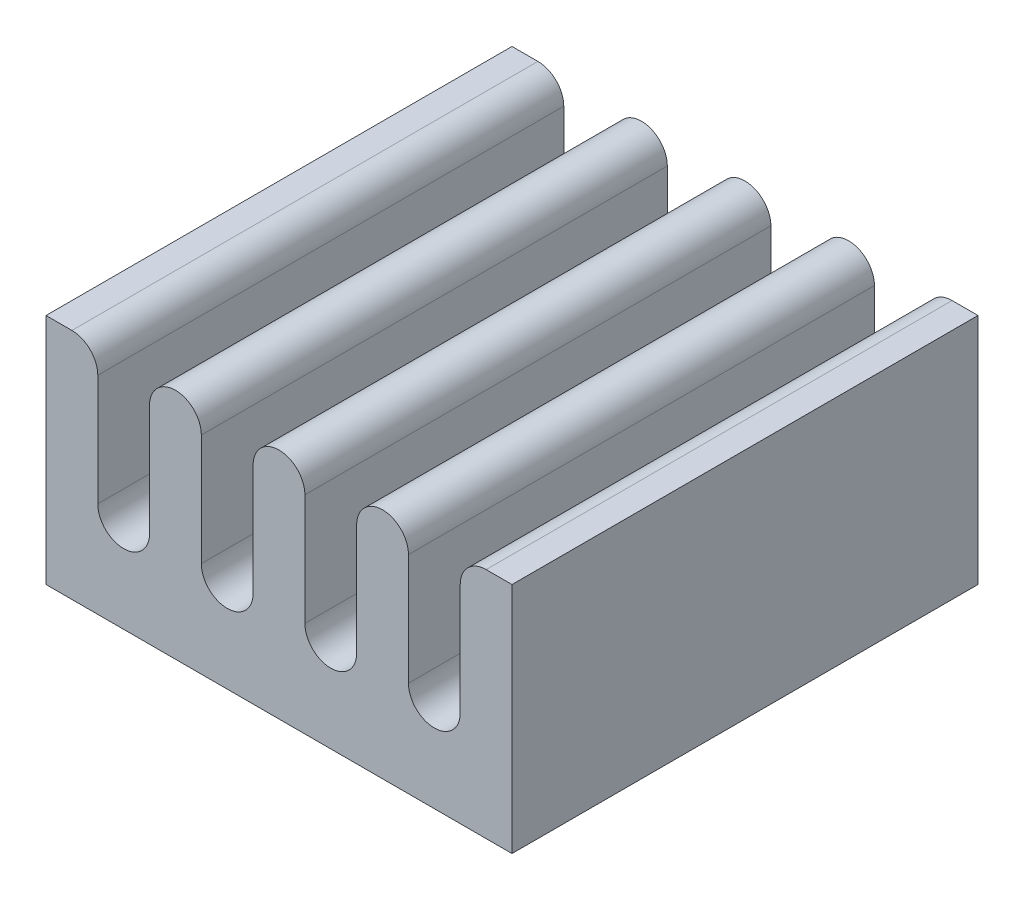
ISO-10303-21;
HEADER;
FILE_DESCRIPTION(('STEP AP214'),'2;1');
FILE_NAME('part.step','',(''),(''),'','','');
FILE_SCHEMA(('AUTOMOTIVE_DESIGN { 1 0 10303 214 1 1 1 1 }'));
ENDSEC;
DATA;
#1=APPLICATION_CONTEXT('core data for automotive mechanical design processes');
#2=APPLICATION_PROTOCOL_DEFINITION('international standard','automotive_design',2000,#1);
#3=PRODUCT_CONTEXT('',#1,'mechanical');
#4=PRODUCT('Part','Part','',(#3));
#5=PRODUCT_RELATED_PRODUCT_CATEGORY('part','',(#4));
#6=PRODUCT_DEFINITION_FORMATION('','',#4);
#7=PRODUCT_DEFINITION_CONTEXT('part definition',#1,'design');
#8=PRODUCT_DEFINITION('design','',#6,#7);
#9=PRODUCT_DEFINITION_SHAPE('','',#8);
#10=(LENGTH_UNIT() NAMED_UNIT(*) SI_UNIT(.MILLI.,.METRE.));
#11=(NAMED_UNIT(*) PLANE_ANGLE_UNIT() SI_UNIT($,.RADIAN.));
#12=(NAMED_UNIT(*) SI_UNIT($,.STERADIAN.) SOLID_ANGLE_UNIT());
#13=UNCERTAINTY_MEASURE_WITH_UNIT(LENGTH_MEASURE(1.E-05),#10,'distance_accuracy_value','');
#14=(GEOMETRIC_REPRESENTATION_CONTEXT(3) GLOBAL_UNCERTAINTY_ASSIGNED_CONTEXT((#13)) GLOBAL_UNIT_ASSIGNED_CONTEXT((#10,
#11,#12)) REPRESENTATION_CONTEXT('',''));
#15=CARTESIAN_POINT('',(0.,0.,0.));
#16=DIRECTION('',(0.,0.,1.));
#17=DIRECTION('',(1.,0.,0.));
#18=AXIS2_PLACEMENT_3D('',#15,#16,#17);
#19=CARTESIAN_POINT('',(4.,4.5,-4.5));
#20=DIRECTION('',(0.,0.,1.));
#21=DIRECTION('',(1.,0.,0.));
#22=AXIS2_PLACEMENT_3D('',#19,#20,#21);
#23=CYLINDRICAL_SURFACE('',#22,0.5);
#24=CARTESIAN_POINT('',(4.,4.5,-4.5));
#25=DIRECTION('',(0.,0.,1.));
#26=DIRECTION('',(1.,0.,0.));
#27=AXIS2_PLACEMENT_3D('',#24,#25,#26);
#28=CIRCLE('',#27,0.5);
#29=CARTESIAN_POINT('',(4.,5.,-4.5));
#30=VERTEX_POINT('',#29);
#31=CARTESIAN_POINT('',(3.5,4.5,-4.5));
#32=VERTEX_POINT('',#31);
#33=EDGE_CURVE('E416',#30,#32,#28,.T.);
#34=ORIENTED_EDGE('',*,*,#33,.T.);
#35=DIRECTION('',(0.,0.,1.));
#36=VECTOR('',#35,1.);
#37=CARTESIAN_POINT('',(3.5,4.5,-4.5));
#38=LINE('',#37,#36);
#39=CARTESIAN_POINT('',(3.5,4.5,4.5));
#40=VERTEX_POINT('',#39);
#41=EDGE_CURVE('E316',#32,#40,#38,.T.);
#42=ORIENTED_EDGE('',*,*,#41,.T.);
#43=CARTESIAN_POINT('',(4.,4.5,4.5));
#44=DIRECTION('',(0.,0.,-1.));
#45=DIRECTION('',(1.,0.,0.));
#46=AXIS2_PLACEMENT_3D('',#43,#44,#45);
#47=CIRCLE('',#46,0.5);
#48=CARTESIAN_POINT('',(4.,5.,4.5));
#49=VERTEX_POINT('',#48);
#50=EDGE_CURVE('E439',#40,#49,#47,.T.);
#51=ORIENTED_EDGE('',*,*,#50,.T.);
#52=DIRECTION('',(0.,0.,1.));
#53=VECTOR('',#52,1.);
#54=CARTESIAN_POINT('',(4.,5.,0.));
#55=LINE('',#54,#53);
#56=EDGE_CURVE('E11',#30,#49,#55,.T.);
#57=ORIENTED_EDGE('',*,*,#56,.F.);
#58=EDGE_LOOP('',(#34,#42,#51,#57));
#59=FACE_BOUND('',#58,.T.);
#60=ADVANCED_FACE('F17',(#59),#23,.T.);
#61=CARTESIAN_POINT('',(3.,2.35,-4.5));
#62=DIRECTION('',(0.,0.,-1.));
#63=DIRECTION('',(-1.,0.,0.));
#64=AXIS2_PLACEMENT_3D('',#61,#62,#63);
#65=CYLINDRICAL_SURFACE('',#64,0.5);
#66=CARTESIAN_POINT('',(3.,2.35,4.5));
#67=DIRECTION('',(0.,0.,-1.));
#68=DIRECTION('',(-1.,0.,0.));
#69=AXIS2_PLACEMENT_3D('',#66,#67,#68);
#70=CIRCLE('',#69,0.5);
#71=CARTESIAN_POINT('',(3.5,2.35,4.5));
#72=VERTEX_POINT('',#71);
#73=CARTESIAN_POINT('',(2.5,2.35,4.5));
#74=VERTEX_POINT('',#73);
#75=EDGE_CURVE('E444',#72,#74,#70,.T.);
#76=ORIENTED_EDGE('',*,*,#75,.F.);
#77=DIRECTION('',(0.,0.,-1.));
#78=VECTOR('',#77,1.);
#79=CARTESIAN_POINT('',(3.5,2.35,-4.5));
#80=LINE('',#79,#78);
#81=CARTESIAN_POINT('',(3.5,2.35,-4.5));
#82=VERTEX_POINT('',#81);
#83=EDGE_CURVE('E313',#72,#82,#80,.T.);
#84=ORIENTED_EDGE('',*,*,#83,.T.);
#85=CARTESIAN_POINT('',(3.,2.35,-4.5));
#86=DIRECTION('',(0.,0.,1.));
#87=DIRECTION('',(-1.,0.,0.));
#88=AXIS2_PLACEMENT_3D('',#85,#86,#87);
#89=CIRCLE('',#88,0.5);
#90=CARTESIAN_POINT('',(2.5,2.35,-4.5));
#91=VERTEX_POINT('',#90);
#92=EDGE_CURVE('E406',#91,#82,#89,.T.);
#93=ORIENTED_EDGE('',*,*,#92,.F.);
#94=DIRECTION('',(0.,0.,1.));
#95=VECTOR('',#94,1.);
#96=CARTESIAN_POINT('',(2.5,2.35,-4.5));
#97=LINE('',#96,#95);
#98=EDGE_CURVE('E312',#91,#74,#97,.T.);
#99=ORIENTED_EDGE('',*,*,#98,.T.);
#100=EDGE_LOOP('',(#76,#84,#93,#99));
#101=FACE_BOUND('',#100,.T.);
#102=ADVANCED_FACE('F1116',(#101),#65,.F.);
#103=CARTESIAN_POINT('',(2.,4.5,-4.5));
#104=DIRECTION('',(0.,0.,1.));
#105=DIRECTION('',(1.,0.,0.));
#106=AXIS2_PLACEMENT_3D('',#103,#104,#105);
#107=CYLINDRICAL_SURFACE('',#106,0.5);
#108=CARTESIAN_POINT('',(2.,4.5,-4.5));
#109=DIRECTION('',(0.,0.,1.));
#110=DIRECTION('',(1.,0.,0.));
#111=AXIS2_PLACEMENT_3D('',#108,#109,#110);
#112=CIRCLE('',#111,0.5);
#113=CARTESIAN_POINT('',(2.5,4.5,-4.5));
#114=VERTEX_POINT('',#113);
#115=CARTESIAN_POINT('',(1.5,4.5,-4.5));
#116=VERTEX_POINT('',#115);
#117=EDGE_CURVE('E394',#114,#116,#112,.T.);
#118=ORIENTED_EDGE('',*,*,#117,.T.);
#119=DIRECTION('',(0.,0.,1.));
#120=VECTOR('',#119,1.);
#121=CARTESIAN_POINT('',(1.5,4.5,-4.5));
#122=LINE('',#121,#120);
#123=CARTESIAN_POINT('',(1.5,4.5,4.5));
#124=VERTEX_POINT('',#123);
#125=EDGE_CURVE('E309',#116,#124,#122,.T.);
#126=ORIENTED_EDGE('',*,*,#125,.T.);
#127=CARTESIAN_POINT('',(2.,4.5,4.5));
#128=DIRECTION('',(0.,0.,-1.));
#129=DIRECTION('',(1.,0.,0.));
#130=AXIS2_PLACEMENT_3D('',#127,#128,#129);
#131=CIRCLE('',#130,0.5);
#132=CARTESIAN_POINT('',(2.5,4.5,4.5));
#133=VERTEX_POINT('',#132);
#134=EDGE_CURVE('E452',#124,#133,#131,.T.);
#135=ORIENTED_EDGE('',*,*,#134,.T.);
#136=DIRECTION('',(0.,0.,-1.));
#137=VECTOR('',#136,1.);
#138=CARTESIAN_POINT('',(2.5,4.5,-4.5));
#139=LINE('',#138,#137);
#140=EDGE_CURVE('E317',#133,#114,#139,.T.);
#141=ORIENTED_EDGE('',*,*,#140,.T.);
#142=EDGE_LOOP('',(#118,#126,#135,#141));
#143=FACE_BOUND('',#142,.T.);
#144=ADVANCED_FACE('F1099',(#143),#107,.T.);
#145=CARTESIAN_POINT('',(1.,2.35,-4.5));
#146=DIRECTION('',(0.,0.,-1.));
#147=DIRECTION('',(-1.,0.,0.));
#148=AXIS2_PLACEMENT_3D('',#145,#146,#147);
#149=CYLINDRICAL_SURFACE('',#148,0.5);
#150=CARTESIAN_POINT('',(1.,2.35,4.5));
#151=DIRECTION('',(0.,0.,-1.));
#152=DIRECTION('',(-1.,0.,0.));
#153=AXIS2_PLACEMENT_3D('',#150,#151,#152);
#154=CIRCLE('',#153,0.5);
#155=CARTESIAN_POINT('',(1.5,2.35,4.5));
#156=VERTEX_POINT('',#155);
#157=CARTESIAN_POINT('',(0.5,2.35,4.5));
#158=VERTEX_POINT('',#157);
#159=EDGE_CURVE('E460',#156,#158,#154,.T.);
#160=ORIENTED_EDGE('',*,*,#159,.F.);
#161=DIRECTION('',(0.,0.,-1.));
#162=VECTOR('',#161,1.);
#163=CARTESIAN_POINT('',(1.5,2.35,-4.5));
#164=LINE('',#163,#162);
#165=CARTESIAN_POINT('',(1.5,2.35,-4.5));
#166=VERTEX_POINT('',#165);
#167=EDGE_CURVE('E306',#156,#166,#164,.T.);
#168=ORIENTED_EDGE('',*,*,#167,.T.);
#169=CARTESIAN_POINT('',(1.,2.35,-4.5));
#170=DIRECTION('',(0.,0.,1.));
#171=DIRECTION('',(-1.,0.,0.));
#172=AXIS2_PLACEMENT_3D('',#169,#170,#171);
#173=CIRCLE('',#172,0.5);
#174=CARTESIAN_POINT('',(0.5,2.35,-4.5));
#175=VERTEX_POINT('',#174);
#176=EDGE_CURVE('E384',#175,#166,#173,.T.);
#177=ORIENTED_EDGE('',*,*,#176,.F.);
#178=DIRECTION('',(0.,0.,1.));
#179=VECTOR('',#178,1.);
#180=CARTESIAN_POINT('',(0.5,2.35,-4.5));
#181=LINE('',#180,#179);
#182=EDGE_CURVE('E300',#175,#158,#181,.T.);
#183=ORIENTED_EDGE('',*,*,#182,.T.);
#184=EDGE_LOOP('',(#160,#168,#177,#183));
#185=FACE_BOUND('',#184,.T.);
#186=ADVANCED_FACE('F1095',(#185),#149,.F.);
#187=CARTESIAN_POINT('',(0.,4.5,-4.5));
#188=DIRECTION('',(0.,0.,1.));
#189=DIRECTION('',(1.,0.,0.));
#190=AXIS2_PLACEMENT_3D('',#187,#188,#189);
#191=CYLINDRICAL_SURFACE('',#190,0.5);
#192=CARTESIAN_POINT('',(0.,4.5,-4.5));
#193=DIRECTION('',(0.,0.,1.));
#194=DIRECTION('',(1.,0.,0.));
#195=AXIS2_PLACEMENT_3D('',#192,#193,#194);
#196=CIRCLE('',#195,0.5);
#197=CARTESIAN_POINT('',(0.5,4.5,-4.5));
#198=VERTEX_POINT('',#197);
#199=CARTESIAN_POINT('',(-0.5,4.5,-4.5));
#200=VERTEX_POINT('',#199);
#201=EDGE_CURVE('E376',#198,#200,#196,.T.);
#202=ORIENTED_EDGE('',*,*,#201,.T.);
#203=DIRECTION('',(0.,0.,1.));
#204=VECTOR('',#203,1.);
#205=CARTESIAN_POINT('',(-0.5,4.5,-4.5));
#206=LINE('',#205,#204);
#207=CARTESIAN_POINT('',(-0.5,4.5,4.5));
#208=VERTEX_POINT('',#207);
#209=EDGE_CURVE('E297',#200,#208,#206,.T.);
#210=ORIENTED_EDGE('',*,*,#209,.T.);
#211=CARTESIAN_POINT('',(0.,4.5,4.5));
#212=DIRECTION('',(0.,0.,-1.));
#213=DIRECTION('',(1.,0.,0.));
#214=AXIS2_PLACEMENT_3D('',#211,#212,#213);
#215=CIRCLE('',#214,0.5);
#216=CARTESIAN_POINT('',(0.5,4.5,4.5));
#217=VERTEX_POINT('',#216);
#218=EDGE_CURVE('E468',#208,#217,#215,.T.);
#219=ORIENTED_EDGE('',*,*,#218,.T.);
#220=DIRECTION('',(0.,0.,-1.));
#221=VECTOR('',#220,1.);
#222=CARTESIAN_POINT('',(0.5,4.5,-4.5));
#223=LINE('',#222,#221);
#224=EDGE_CURVE('E303',#217,#198,#223,.T.);
#225=ORIENTED_EDGE('',*,*,#224,.T.);
#226=EDGE_LOOP('',(#202,#210,#219,#225));
#227=FACE_BOUND('',#226,.T.);
#228=ADVANCED_FACE('F1089',(#227),#191,.T.);
#229=CARTESIAN_POINT('',(-1.,2.35,-4.5));
#230=DIRECTION('',(0.,0.,-1.));
#231=DIRECTION('',(-1.,0.,0.));
#232=AXIS2_PLACEMENT_3D('',#229,#230,#231);
#233=CYLINDRICAL_SURFACE('',#232,0.5);
#234=CARTESIAN_POINT('',(-1.,2.35,4.5));
#235=DIRECTION('',(0.,0.,-1.));
#236=DIRECTION('',(-1.,0.,0.));
#237=AXIS2_PLACEMENT_3D('',#234,#235,#236);
#238=CIRCLE('',#237,0.5);
#239=CARTESIAN_POINT('',(-0.5,2.35,4.5));
#240=VERTEX_POINT('',#239);
#241=CARTESIAN_POINT('',(-1.5,2.35,4.5));
#242=VERTEX_POINT('',#241);
#243=EDGE_CURVE('E476',#240,#242,#238,.T.);
#244=ORIENTED_EDGE('',*,*,#243,.F.);
#245=DIRECTION('',(0.,0.,-1.));
#246=VECTOR('',#245,1.);
#247=CARTESIAN_POINT('',(-0.5,2.35,-4.5));
#248=LINE('',#247,#246);
#249=CARTESIAN_POINT('',(-0.5,2.35,-4.5));
#250=VERTEX_POINT('',#249);
#251=EDGE_CURVE('E294',#240,#250,#248,.T.);
#252=ORIENTED_EDGE('',*,*,#251,.T.);
#253=CARTESIAN_POINT('',(-1.,2.35,-4.5));
#254=DIRECTION('',(0.,0.,1.));
#255=DIRECTION('',(-1.,0.,0.));
#256=AXIS2_PLACEMENT_3D('',#253,#254,#255);
#257=CIRCLE('',#256,0.5);
#258=CARTESIAN_POINT('',(-1.5,2.35,-4.5));
#259=VERTEX_POINT('',#258);
#260=EDGE_CURVE('E368',#259,#250,#257,.T.);
#261=ORIENTED_EDGE('',*,*,#260,.F.);
#262=DIRECTION('',(0.,0.,1.));
#263=VECTOR('',#262,1.);
#264=CARTESIAN_POINT('',(-1.5,2.35,-4.5));
#265=LINE('',#264,#263);
#266=EDGE_CURVE('E289',#259,#242,#265,.T.);
#267=ORIENTED_EDGE('',*,*,#266,.T.);
#268=EDGE_LOOP('',(#244,#252,#261,#267));
#269=FACE_BOUND('',#268,.T.);
#270=ADVANCED_FACE('F1080',(#269),#233,.F.);
#271=CARTESIAN_POINT('',(-2.,4.5,-4.5));
#272=DIRECTION('',(0.,0.,1.));
#273=DIRECTION('',(1.,0.,0.));
#274=AXIS2_PLACEMENT_3D('',#271,#272,#273);
#275=CYLINDRICAL_SURFACE('',#274,0.5);
#276=CARTESIAN_POINT('',(-2.,4.5,-4.5));
#277=DIRECTION('',(0.,0.,1.));
#278=DIRECTION('',(1.,0.,0.));
#279=AXIS2_PLACEMENT_3D('',#276,#277,#278);
#280=CIRCLE('',#279,0.5);
#281=CARTESIAN_POINT('',(-1.5,4.5,-4.5));
#282=VERTEX_POINT('',#281);
#283=CARTESIAN_POINT('',(-2.5,4.5,-4.5));
#284=VERTEX_POINT('',#283);
#285=EDGE_CURVE('E663',#282,#284,#280,.T.);
#286=ORIENTED_EDGE('',*,*,#285,.T.);
#287=DIRECTION('',(0.,0.,1.));
#288=VECTOR('',#287,1.);
#289=CARTESIAN_POINT('',(-2.5,4.5,-4.5));
#290=LINE('',#289,#288);
#291=CARTESIAN_POINT('',(-2.5,4.5,4.5));
#292=VERTEX_POINT('',#291);
#293=EDGE_CURVE('E293',#284,#292,#290,.T.);
#294=ORIENTED_EDGE('',*,*,#293,.T.);
#295=CARTESIAN_POINT('',(-2.,4.5,4.5));
#296=DIRECTION('',(0.,0.,-1.));
#297=DIRECTION('',(1.,0.,0.));
#298=AXIS2_PLACEMENT_3D('',#295,#296,#297);
#299=CIRCLE('',#298,0.5);
#300=CARTESIAN_POINT('',(-1.5,4.5,4.5));
#301=VERTEX_POINT('',#300);
#302=EDGE_CURVE('E362',#292,#301,#299,.T.);
#303=ORIENTED_EDGE('',*,*,#302,.T.);
#304=DIRECTION('',(0.,0.,-1.));
#305=VECTOR('',#304,1.);
#306=CARTESIAN_POINT('',(-1.5,4.5,-4.5));
#307=LINE('',#306,#305);
#308=EDGE_CURVE('E292',#301,#282,#307,.T.);
#309=ORIENTED_EDGE('',*,*,#308,.T.);
#310=EDGE_LOOP('',(#286,#294,#303,#309));
#311=FACE_BOUND('',#310,.T.);
#312=ADVANCED_FACE('F1072',(#311),#275,.T.);
#313=CARTESIAN_POINT('',(-4.,4.5,-4.5));
#314=DIRECTION('',(0.,0.,-1.));
#315=DIRECTION('',(-1.,0.,0.));
#316=AXIS2_PLACEMENT_3D('',#313,#314,#315);
#317=CYLINDRICAL_SURFACE('',#316,0.5);
#318=CARTESIAN_POINT('',(-4.,4.5,4.5));
#319=DIRECTION('',(0.,0.,-1.));
#320=DIRECTION('',(-1.,0.,0.));
#321=AXIS2_PLACEMENT_3D('',#318,#319,#320);
#322=CIRCLE('',#321,0.5);
#323=CARTESIAN_POINT('',(-4.,5.,4.5));
#324=VERTEX_POINT('',#323);
#325=CARTESIAN_POINT('',(-3.5,4.5,4.5));
#326=VERTEX_POINT('',#325);
#327=EDGE_CURVE('E496',#324,#326,#322,.T.);
#328=ORIENTED_EDGE('',*,*,#327,.T.);
#329=DIRECTION('',(0.,0.,-1.));
#330=VECTOR('',#329,1.);
#331=CARTESIAN_POINT('',(-3.5,4.5,-4.5));
#332=LINE('',#331,#330);
#333=CARTESIAN_POINT('',(-3.5,4.5,-4.5));
#334=VERTEX_POINT('',#333);
#335=EDGE_CURVE('E285',#326,#334,#332,.T.);
#336=ORIENTED_EDGE('',*,*,#335,.T.);
#337=CARTESIAN_POINT('',(-4.,4.5,-4.5));
#338=DIRECTION('',(0.,0.,1.));
#339=DIRECTION('',(-1.,0.,0.));
#340=AXIS2_PLACEMENT_3D('',#337,#338,#339);
#341=CIRCLE('',#340,0.5);
#342=CARTESIAN_POINT('',(-4.,5.,-4.5));
#343=VERTEX_POINT('',#342);
#344=EDGE_CURVE('E335',#334,#343,#341,.T.);
#345=ORIENTED_EDGE('',*,*,#344,.T.);
#346=DIRECTION('',(0.,0.,-1.));
#347=VECTOR('',#346,1.);
#348=CARTESIAN_POINT('',(-4.,5.,0.));
#349=LINE('',#348,#347);
#350=EDGE_CURVE('E26',#324,#343,#349,.T.);
#351=ORIENTED_EDGE('',*,*,#350,.F.);
#352=EDGE_LOOP('',(#328,#336,#345,#351));
#353=FACE_BOUND('',#352,.T.);
#354=ADVANCED_FACE('F336',(#353),#317,.T.);
#355=CARTESIAN_POINT('',(-3.,2.35,-4.5));
#356=DIRECTION('',(0.,0.,-1.));
#357=DIRECTION('',(-1.,0.,0.));
#358=AXIS2_PLACEMENT_3D('',#355,#356,#357);
#359=CYLINDRICAL_SURFACE('',#358,0.5);
#360=CARTESIAN_POINT('',(-3.,2.35,4.5));
#361=DIRECTION('',(0.,0.,-1.));
#362=DIRECTION('',(-1.,0.,0.));
#363=AXIS2_PLACEMENT_3D('',#360,#361,#362);
#364=CIRCLE('',#363,0.5);
#365=CARTESIAN_POINT('',(-2.5,2.35,4.5));
#366=VERTEX_POINT('',#365);
#367=CARTESIAN_POINT('',(-3.5,2.35,4.5));
#368=VERTEX_POINT('',#367);
#369=EDGE_CURVE('E361',#366,#368,#364,.T.);
#370=ORIENTED_EDGE('',*,*,#369,.F.);
#371=DIRECTION('',(0.,0.,-1.));
#372=VECTOR('',#371,1.);
#373=CARTESIAN_POINT('',(-2.5,2.35,-4.5));
#374=LINE('',#373,#372);
#375=CARTESIAN_POINT('',(-2.5,2.35,-4.5));
#376=VERTEX_POINT('',#375);
#377=EDGE_CURVE('E288',#366,#376,#374,.T.);
#378=ORIENTED_EDGE('',*,*,#377,.T.);
#379=CARTESIAN_POINT('',(-3.,2.35,-4.5));
#380=DIRECTION('',(0.,0.,1.));
#381=DIRECTION('',(-1.,0.,0.));
#382=AXIS2_PLACEMENT_3D('',#379,#380,#381);
#383=CIRCLE('',#382,0.5);
#384=CARTESIAN_POINT('',(-3.5,2.35,-4.5));
#385=VERTEX_POINT('',#384);
#386=EDGE_CURVE('E363',#385,#376,#383,.T.);
#387=ORIENTED_EDGE('',*,*,#386,.F.);
#388=DIRECTION('',(0.,0.,1.));
#389=VECTOR('',#388,1.);
#390=CARTESIAN_POINT('',(-3.5,2.35,-4.5));
#391=LINE('',#390,#389);
#392=EDGE_CURVE('E282',#385,#368,#391,.T.);
#393=ORIENTED_EDGE('',*,*,#392,.T.);
#394=EDGE_LOOP('',(#370,#378,#387,#393));
#395=FACE_BOUND('',#394,.T.);
#396=ADVANCED_FACE('F1056',(#395),#359,.F.);
#397=CARTESIAN_POINT('',(0.,0.,0.));
#398=DIRECTION('',(0.,1.,0.));
#399=DIRECTION('',(1.,0.,0.));
#400=AXIS2_PLACEMENT_3D('',#397,#398,#399);
#401=PLANE('',#400);
#402=DIRECTION('',(-1.,0.,0.));
#403=VECTOR('',#402,1.);
#404=CARTESIAN_POINT('',(-3.5,0.,-4.));
#405=LINE('',#404,#403);
#406=CARTESIAN_POINT('',(2.5,0.,-4.));
#407=VERTEX_POINT('',#406);
#408=CARTESIAN_POINT('',(-3.5,0.,-4.));
#409=VERTEX_POINT('',#408);
#410=EDGE_CURVE('E239',#407,#409,#405,.T.);
#411=ORIENTED_EDGE('',*,*,#410,.F.);
#412=DIRECTION('',(0.,0.,-1.));
#413=VECTOR('',#412,1.);
#414=CARTESIAN_POINT('',(2.5,0.,2.));
#415=LINE('',#414,#413);
#416=CARTESIAN_POINT('',(2.5,0.,2.));
#417=VERTEX_POINT('',#416);
#418=EDGE_CURVE('E279',#417,#407,#415,.T.);
#419=ORIENTED_EDGE('',*,*,#418,.F.);
#420=DIRECTION('',(1.,0.,0.));
#421=VECTOR('',#420,1.);
#422=CARTESIAN_POINT('',(-3.5,0.,2.));
#423=LINE('',#422,#421);
#424=CARTESIAN_POINT('',(-3.5,0.,2.));
#425=VERTEX_POINT('',#424);
#426=EDGE_CURVE('E39',#425,#417,#423,.T.);
#427=ORIENTED_EDGE('',*,*,#426,.F.);
#428=DIRECTION('',(0.,0.,1.));
#429=VECTOR('',#428,1.);
#430=CARTESIAN_POINT('',(-3.5,0.,2.));
#431=LINE('',#430,#429);
#432=EDGE_CURVE('E252',#409,#425,#431,.T.);
#433=ORIENTED_EDGE('',*,*,#432,.F.);
#434=EDGE_LOOP('',(#411,#419,#427,#433));
#435=FACE_BOUND('',#434,.T.);
#436=ADVANCED_FACE('F253',(#435),#401,.F.);
#437=CARTESIAN_POINT('',(0.,5.,0.));
#438=DIRECTION('',(0.,1.,0.));
#439=DIRECTION('',(1.,0.,0.));
#440=AXIS2_PLACEMENT_3D('',#437,#438,#439);
#441=PLANE('',#440);
#442=DIRECTION('',(1.,0.,0.));
#443=VECTOR('',#442,1.);
#444=CARTESIAN_POINT('',(0.,5.,4.5));
#445=LINE('',#444,#443);
#446=CARTESIAN_POINT('',(4.5,5.,4.5));
#447=VERTEX_POINT('',#446);
#448=EDGE_CURVE('E435',#49,#447,#445,.T.);
#449=ORIENTED_EDGE('',*,*,#448,.T.);
#450=DIRECTION('',(0.,0.,-1.));
#451=VECTOR('',#450,1.);
#452=CARTESIAN_POINT('',(4.5,5.,-4.5));
#453=LINE('',#452,#451);
#454=CARTESIAN_POINT('',(4.5,5.,-4.5));
#455=VERTEX_POINT('',#454);
#456=EDGE_CURVE('E264',#447,#455,#453,.T.);
#457=ORIENTED_EDGE('',*,*,#456,.T.);
#458=DIRECTION('',(-1.,0.,0.));
#459=VECTOR('',#458,1.);
#460=CARTESIAN_POINT('',(0.,5.,-4.5));
#461=LINE('',#460,#459);
#462=EDGE_CURVE('E420',#455,#30,#461,.T.);
#463=ORIENTED_EDGE('',*,*,#462,.T.);
#464=ORIENTED_EDGE('',*,*,#56,.T.);
#465=EDGE_LOOP('',(#449,#457,#463,#464));
#466=FACE_BOUND('',#465,.T.);
#467=ADVANCED_FACE('F1040',(#466),#441,.T.);
#468=CARTESIAN_POINT('',(0.,5.,0.));
#469=DIRECTION('',(0.,1.,0.));
#470=DIRECTION('',(1.,0.,0.));
#471=AXIS2_PLACEMENT_3D('',#468,#469,#470);
#472=PLANE('',#471);
#473=DIRECTION('',(-1.,0.,0.));
#474=VECTOR('',#473,1.);
#475=CARTESIAN_POINT('',(0.,5.,-4.5));
#476=LINE('',#475,#474);
#477=CARTESIAN_POINT('',(-4.5,5.,-4.5));
#478=VERTEX_POINT('',#477);
#479=EDGE_CURVE('E329',#343,#478,#476,.T.);
#480=ORIENTED_EDGE('',*,*,#479,.T.);
#481=DIRECTION('',(0.,0.,1.));
#482=VECTOR('',#481,1.);
#483=CARTESIAN_POINT('',(-4.5,5.,-4.5));
#484=LINE('',#483,#482);
#485=CARTESIAN_POINT('',(-4.5,5.,4.5));
#486=VERTEX_POINT('',#485);
#487=EDGE_CURVE('E431',#478,#486,#484,.T.);
#488=ORIENTED_EDGE('',*,*,#487,.T.);
#489=DIRECTION('',(1.,0.,0.));
#490=VECTOR('',#489,1.);
#491=CARTESIAN_POINT('',(-4.5,5.,4.5));
#492=LINE('',#491,#490);
#493=EDGE_CURVE('E270',#486,#324,#492,.T.);
#494=ORIENTED_EDGE('',*,*,#493,.T.);
#495=ORIENTED_EDGE('',*,*,#350,.T.);
#496=EDGE_LOOP('',(#480,#488,#494,#495));
#497=FACE_BOUND('',#496,.T.);
#498=ADVANCED_FACE('F326',(#497),#472,.T.);
#499=CARTESIAN_POINT('',(3.5,-9.05538513813741,-4.5));
#500=DIRECTION('',(1.,0.,0.));
#501=DIRECTION('',(0.,0.,-1.));
#502=AXIS2_PLACEMENT_3D('',#499,#500,#501);
#503=PLANE('',#502);
#504=ORIENTED_EDGE('',*,*,#83,.F.);
#505=DIRECTION('',(0.,1.,0.));
#506=VECTOR('',#505,1.);
#507=CARTESIAN_POINT('',(3.5,5.,4.5));
#508=LINE('',#507,#506);
#509=EDGE_CURVE('E440',#72,#40,#508,.T.);
#510=ORIENTED_EDGE('',*,*,#509,.T.);
#511=ORIENTED_EDGE('',*,*,#41,.F.);
#512=DIRECTION('',(0.,-1.,0.));
#513=VECTOR('',#512,1.);
#514=CARTESIAN_POINT('',(3.5,5.,-4.5));
#515=LINE('',#514,#513);
#516=EDGE_CURVE('E412',#32,#82,#515,.T.);
#517=ORIENTED_EDGE('',*,*,#516,.T.);
#518=EDGE_LOOP('',(#504,#510,#511,#517));
#519=FACE_BOUND('',#518,.T.);
#520=ADVANCED_FACE('F990',(#519),#503,.F.);
#521=CARTESIAN_POINT('',(2.5,-9.05538513813741,-4.5));
#522=DIRECTION('',(-1.,0.,0.));
#523=DIRECTION('',(0.,1.,0.));
#524=AXIS2_PLACEMENT_3D('',#521,#522,#523);
#525=PLANE('',#524);
#526=ORIENTED_EDGE('',*,*,#98,.F.);
#527=DIRECTION('',(0.,1.,0.));
#528=VECTOR('',#527,1.);
#529=CARTESIAN_POINT('',(2.5,5.,-4.5));
#530=LINE('',#529,#528);
#531=EDGE_CURVE('E400',#91,#114,#530,.T.);
#532=ORIENTED_EDGE('',*,*,#531,.T.);
#533=ORIENTED_EDGE('',*,*,#140,.F.);
#534=DIRECTION('',(0.,-1.,0.));
#535=VECTOR('',#534,1.);
#536=CARTESIAN_POINT('',(2.5,5.,4.5));
#537=LINE('',#536,#535);
#538=EDGE_CURVE('E448',#133,#74,#537,.T.);
#539=ORIENTED_EDGE('',*,*,#538,.T.);
#540=EDGE_LOOP('',(#526,#532,#533,#539));
#541=FACE_BOUND('',#540,.T.);
#542=ADVANCED_FACE('F985',(#541),#525,.F.);
#543=CARTESIAN_POINT('',(1.5,-9.05538513813741,-4.5));
#544=DIRECTION('',(1.,0.,0.));
#545=DIRECTION('',(0.,0.,-1.));
#546=AXIS2_PLACEMENT_3D('',#543,#544,#545);
#547=PLANE('',#546);
#548=ORIENTED_EDGE('',*,*,#167,.F.);
#549=DIRECTION('',(0.,1.,0.));
#550=VECTOR('',#549,1.);
#551=CARTESIAN_POINT('',(1.5,5.,4.5));
#552=LINE('',#551,#550);
#553=EDGE_CURVE('E456',#156,#124,#552,.T.);
#554=ORIENTED_EDGE('',*,*,#553,.T.);
#555=ORIENTED_EDGE('',*,*,#125,.F.);
#556=DIRECTION('',(0.,-1.,0.));
#557=VECTOR('',#556,1.);
#558=CARTESIAN_POINT('',(1.5,5.,-4.5));
#559=LINE('',#558,#557);
#560=EDGE_CURVE('E390',#116,#166,#559,.T.);
#561=ORIENTED_EDGE('',*,*,#560,.T.);
#562=EDGE_LOOP('',(#548,#554,#555,#561));
#563=FACE_BOUND('',#562,.T.);
#564=ADVANCED_FACE('F989',(#563),#547,.F.);
#565=CARTESIAN_POINT('',(0.5,-9.05538513813741,-4.5));
#566=DIRECTION('',(-1.,0.,0.));
#567=DIRECTION('',(0.,1.,0.));
#568=AXIS2_PLACEMENT_3D('',#565,#566,#567);
#569=PLANE('',#568);
#570=ORIENTED_EDGE('',*,*,#182,.F.);
#571=DIRECTION('',(0.,1.,0.));
#572=VECTOR('',#571,1.);
#573=CARTESIAN_POINT('',(0.5,5.,-4.5));
#574=LINE('',#573,#572);
#575=EDGE_CURVE('E380',#175,#198,#574,.T.);
#576=ORIENTED_EDGE('',*,*,#575,.T.);
#577=ORIENTED_EDGE('',*,*,#224,.F.);
#578=DIRECTION('',(0.,-1.,0.));
#579=VECTOR('',#578,1.);
#580=CARTESIAN_POINT('',(0.5,5.,4.5));
#581=LINE('',#580,#579);
#582=EDGE_CURVE('E464',#217,#158,#581,.T.);
#583=ORIENTED_EDGE('',*,*,#582,.T.);
#584=EDGE_LOOP('',(#570,#576,#577,#583));
#585=FACE_BOUND('',#584,.T.);
#586=ADVANCED_FACE('F1007',(#585),#569,.F.);
#587=CARTESIAN_POINT('',(-0.5,-9.05538513813741,-4.5));
#588=DIRECTION('',(1.,0.,0.));
#589=DIRECTION('',(0.,0.,-1.));
#590=AXIS2_PLACEMENT_3D('',#587,#588,#589);
#591=PLANE('',#590);
#592=ORIENTED_EDGE('',*,*,#251,.F.);
#593=DIRECTION('',(0.,1.,0.));
#594=VECTOR('',#593,1.);
#595=CARTESIAN_POINT('',(-0.5,5.,4.5));
#596=LINE('',#595,#594);
#597=EDGE_CURVE('E472',#240,#208,#596,.T.);
#598=ORIENTED_EDGE('',*,*,#597,.T.);
#599=ORIENTED_EDGE('',*,*,#209,.F.);
#600=DIRECTION('',(0.,-1.,0.));
#601=VECTOR('',#600,1.);
#602=CARTESIAN_POINT('',(-0.5,5.,-4.5));
#603=LINE('',#602,#601);
#604=EDGE_CURVE('E372',#200,#250,#603,.T.);
#605=ORIENTED_EDGE('',*,*,#604,.T.);
#606=EDGE_LOOP('',(#592,#598,#599,#605));
#607=FACE_BOUND('',#606,.T.);
#608=ADVANCED_FACE('F954',(#607),#591,.F.);
#609=CARTESIAN_POINT('',(-1.5,-9.05538513813741,-4.5));
#610=DIRECTION('',(-1.,0.,0.));
#611=DIRECTION('',(0.,1.,0.));
#612=AXIS2_PLACEMENT_3D('',#609,#610,#611);
#613=PLANE('',#612);
#614=ORIENTED_EDGE('',*,*,#266,.F.);
#615=DIRECTION('',(0.,1.,0.));
#616=VECTOR('',#615,1.);
#617=CARTESIAN_POINT('',(-1.5,5.,-4.5));
#618=LINE('',#617,#616);
#619=EDGE_CURVE('E355',#259,#282,#618,.T.);
#620=ORIENTED_EDGE('',*,*,#619,.T.);
#621=ORIENTED_EDGE('',*,*,#308,.F.);
#622=DIRECTION('',(0.,-1.,0.));
#623=VECTOR('',#622,1.);
#624=CARTESIAN_POINT('',(-1.5,5.,4.5));
#625=LINE('',#624,#623);
#626=EDGE_CURVE('E482',#301,#242,#625,.T.);
#627=ORIENTED_EDGE('',*,*,#626,.T.);
#628=EDGE_LOOP('',(#614,#620,#621,#627));
#629=FACE_BOUND('',#628,.T.);
#630=ADVANCED_FACE('F949',(#629),#613,.F.);
#631=CARTESIAN_POINT('',(-2.5,-9.05538513813741,-4.5));
#632=DIRECTION('',(1.,0.,0.));
#633=DIRECTION('',(0.,0.,-1.));
#634=AXIS2_PLACEMENT_3D('',#631,#632,#633);
#635=PLANE('',#634);
#636=ORIENTED_EDGE('',*,*,#377,.F.);
#637=DIRECTION('',(0.,1.,0.));
#638=VECTOR('',#637,1.);
#639=CARTESIAN_POINT('',(-2.5,5.,4.5));
#640=LINE('',#639,#638);
#641=EDGE_CURVE('E357',#366,#292,#640,.T.);
#642=ORIENTED_EDGE('',*,*,#641,.T.);
#643=ORIENTED_EDGE('',*,*,#293,.F.);
#644=DIRECTION('',(0.,-1.,0.));
#645=VECTOR('',#644,1.);
#646=CARTESIAN_POINT('',(-2.5,5.,-4.5));
#647=LINE('',#646,#645);
#648=EDGE_CURVE('E367',#284,#376,#647,.T.);
#649=ORIENTED_EDGE('',*,*,#648,.T.);
#650=EDGE_LOOP('',(#636,#642,#643,#649));
#651=FACE_BOUND('',#650,.T.);
#652=ADVANCED_FACE('F953',(#651),#635,.F.);
#653=CARTESIAN_POINT('',(-3.5,-9.05538513813741,-4.5));
#654=DIRECTION('',(-1.,0.,0.));
#655=DIRECTION('',(0.,1.,0.));
#656=AXIS2_PLACEMENT_3D('',#653,#654,#655);
#657=PLANE('',#656);
#658=ORIENTED_EDGE('',*,*,#392,.F.);
#659=DIRECTION('',(0.,1.,0.));
#660=VECTOR('',#659,1.);
#661=CARTESIAN_POINT('',(-3.5,5.,-4.5));
#662=LINE('',#661,#660);
#663=EDGE_CURVE('E341',#385,#334,#662,.T.);
#664=ORIENTED_EDGE('',*,*,#663,.T.);
#665=ORIENTED_EDGE('',*,*,#335,.F.);
#666=DIRECTION('',(0.,-1.,0.));
#667=VECTOR('',#666,1.);
#668=CARTESIAN_POINT('',(-3.5,5.,4.5));
#669=LINE('',#668,#667);
#670=EDGE_CURVE('E492',#326,#368,#669,.T.);
#671=ORIENTED_EDGE('',*,*,#670,.T.);
#672=EDGE_LOOP('',(#658,#664,#665,#671));
#673=FACE_BOUND('',#672,.T.);
#674=ADVANCED_FACE('F972',(#673),#657,.F.);
#675=CARTESIAN_POINT('',(-3.5,0.5,2.));
#676=DIRECTION('',(0.,0.,1.));
#677=DIRECTION('',(1.,0.,0.));
#678=AXIS2_PLACEMENT_3D('',#675,#676,#677);
#679=PLANE('',#678);
#680=DIRECTION('',(1.,0.,0.));
#681=VECTOR('',#680,1.);
#682=CARTESIAN_POINT('',(0.,0.5,2.));
#683=LINE('',#682,#681);
#684=CARTESIAN_POINT('',(-3.5,0.5,2.));
#685=VERTEX_POINT('',#684);
#686=CARTESIAN_POINT('',(2.5,0.5,2.));
#687=VERTEX_POINT('',#686);
#688=EDGE_CURVE('E731',#685,#687,#683,.T.);
#689=ORIENTED_EDGE('',*,*,#688,.F.);
#690=DIRECTION('',(0.,1.,0.));
#691=VECTOR('',#690,1.);
#692=CARTESIAN_POINT('',(-3.5,0.5,2.));
#693=LINE('',#692,#691);
#694=EDGE_CURVE('E257',#425,#685,#693,.T.);
#695=ORIENTED_EDGE('',*,*,#694,.F.);
#696=ORIENTED_EDGE('',*,*,#426,.T.);
#697=DIRECTION('',(0.,-1.,0.));
#698=VECTOR('',#697,1.);
#699=CARTESIAN_POINT('',(2.5,0.5,2.));
#700=LINE('',#699,#698);
#701=EDGE_CURVE('E249',#687,#417,#700,.T.);
#702=ORIENTED_EDGE('',*,*,#701,.F.);
#703=EDGE_LOOP('',(#689,#695,#696,#702));
#704=FACE_BOUND('',#703,.T.);
#705=ADVANCED_FACE('F963',(#704),#679,.T.);
#706=CARTESIAN_POINT('',(2.5,0.5,2.));
#707=DIRECTION('',(1.,0.,0.));
#708=DIRECTION('',(0.,0.,1.));
#709=AXIS2_PLACEMENT_3D('',#706,#707,#708);
#710=PLANE('',#709);
#711=DIRECTION('',(0.,0.,-1.));
#712=VECTOR('',#711,1.);
#713=CARTESIAN_POINT('',(2.5,0.5,0.));
#714=LINE('',#713,#712);
#715=CARTESIAN_POINT('',(2.5,0.5,-4.));
#716=VERTEX_POINT('',#715);
#717=EDGE_CURVE('E351',#687,#716,#714,.T.);
#718=ORIENTED_EDGE('',*,*,#717,.F.);
#719=ORIENTED_EDGE('',*,*,#701,.T.);
#720=ORIENTED_EDGE('',*,*,#418,.T.);
#721=DIRECTION('',(0.,-1.,0.));
#722=VECTOR('',#721,1.);
#723=CARTESIAN_POINT('',(2.5,0.5,-4.));
#724=LINE('',#723,#722);
#725=EDGE_CURVE('E246',#716,#407,#724,.T.);
#726=ORIENTED_EDGE('',*,*,#725,.F.);
#727=EDGE_LOOP('',(#718,#719,#720,#726));
#728=FACE_BOUND('',#727,.T.);
#729=ADVANCED_FACE('F944',(#728),#710,.T.);
#730=CARTESIAN_POINT('',(-3.5,0.5,-4.));
#731=DIRECTION('',(0.,0.,-1.));
#732=DIRECTION('',(0.,-1.,0.));
#733=AXIS2_PLACEMENT_3D('',#730,#731,#732);
#734=PLANE('',#733);
#735=DIRECTION('',(-1.,0.,0.));
#736=VECTOR('',#735,1.);
#737=CARTESIAN_POINT('',(0.,0.5,-4.));
#738=LINE('',#737,#736);
#739=CARTESIAN_POINT('',(-3.5,0.5,-4.));
#740=VERTEX_POINT('',#739);
#741=EDGE_CURVE('E710',#716,#740,#738,.T.);
#742=ORIENTED_EDGE('',*,*,#741,.F.);
#743=ORIENTED_EDGE('',*,*,#725,.T.);
#744=ORIENTED_EDGE('',*,*,#410,.T.);
#745=DIRECTION('',(0.,-1.,0.));
#746=VECTOR('',#745,1.);
#747=CARTESIAN_POINT('',(-3.5,0.5,-4.));
#748=LINE('',#747,#746);
#749=EDGE_CURVE('E244',#740,#409,#748,.T.);
#750=ORIENTED_EDGE('',*,*,#749,.F.);
#751=EDGE_LOOP('',(#742,#743,#744,#750));
#752=FACE_BOUND('',#751,.T.);
#753=ADVANCED_FACE('F242',(#752),#734,.T.);
#754=CARTESIAN_POINT('',(-3.5,0.5,2.));
#755=DIRECTION('',(-1.,0.,0.));
#756=DIRECTION('',(0.,0.,1.));
#757=AXIS2_PLACEMENT_3D('',#754,#755,#756);
#758=PLANE('',#757);
#759=DIRECTION('',(0.,0.,1.));
#760=VECTOR('',#759,1.);
#761=CARTESIAN_POINT('',(-3.5,0.5,0.));
#762=LINE('',#761,#760);
#763=EDGE_CURVE('E261',#740,#685,#762,.T.);
#764=ORIENTED_EDGE('',*,*,#763,.F.);
#765=ORIENTED_EDGE('',*,*,#749,.T.);
#766=ORIENTED_EDGE('',*,*,#432,.T.);
#767=ORIENTED_EDGE('',*,*,#694,.T.);
#768=EDGE_LOOP('',(#764,#765,#766,#767));
#769=FACE_BOUND('',#768,.T.);
#770=ADVANCED_FACE('F259',(#769),#758,.T.);
#771=CARTESIAN_POINT('',(4.5,5.,-4.5));
#772=DIRECTION('',(-1.,0.,0.));
#773=DIRECTION('',(0.,1.,0.));
#774=AXIS2_PLACEMENT_3D('',#771,#772,#773);
#775=PLANE('',#774);
#776=DIRECTION('',(0.,1.,0.));
#777=VECTOR('',#776,1.);
#778=CARTESIAN_POINT('',(4.5,5.,-4.5));
#779=LINE('',#778,#777);
#780=CARTESIAN_POINT('',(4.5,0.5,-4.5));
#781=VERTEX_POINT('',#780);
#782=EDGE_CURVE('E424',#781,#455,#779,.T.);
#783=ORIENTED_EDGE('',*,*,#782,.T.);
#784=ORIENTED_EDGE('',*,*,#456,.F.);
#785=DIRECTION('',(0.,-1.,0.));
#786=VECTOR('',#785,1.);
#787=CARTESIAN_POINT('',(4.5,5.,4.5));
#788=LINE('',#787,#786);
#789=CARTESIAN_POINT('',(4.5,0.5,4.5));
#790=VERTEX_POINT('',#789);
#791=EDGE_CURVE('E434',#447,#790,#788,.T.);
#792=ORIENTED_EDGE('',*,*,#791,.T.);
#793=DIRECTION('',(0.,0.,1.));
#794=VECTOR('',#793,1.);
#795=CARTESIAN_POINT('',(4.5,0.5,0.));
#796=LINE('',#795,#794);
#797=EDGE_CURVE('E702',#781,#790,#796,.T.);
#798=ORIENTED_EDGE('',*,*,#797,.F.);
#799=EDGE_LOOP('',(#783,#784,#792,#798));
#800=FACE_BOUND('',#799,.T.);
#801=ADVANCED_FACE('F920',(#800),#775,.F.);
#802=CARTESIAN_POINT('',(-4.5,5.,4.5));
#803=DIRECTION('',(0.,0.,-1.));
#804=DIRECTION('',(0.,-1.,0.));
#805=AXIS2_PLACEMENT_3D('',#802,#803,#804);
#806=PLANE('',#805);
#807=ORIENTED_EDGE('',*,*,#791,.F.);
#808=ORIENTED_EDGE('',*,*,#448,.F.);
#809=ORIENTED_EDGE('',*,*,#50,.F.);
#810=ORIENTED_EDGE('',*,*,#509,.F.);
#811=ORIENTED_EDGE('',*,*,#75,.T.);
#812=ORIENTED_EDGE('',*,*,#538,.F.);
#813=ORIENTED_EDGE('',*,*,#134,.F.);
#814=ORIENTED_EDGE('',*,*,#553,.F.);
#815=ORIENTED_EDGE('',*,*,#159,.T.);
#816=ORIENTED_EDGE('',*,*,#582,.F.);
#817=ORIENTED_EDGE('',*,*,#218,.F.);
#818=ORIENTED_EDGE('',*,*,#597,.F.);
#819=ORIENTED_EDGE('',*,*,#243,.T.);
#820=ORIENTED_EDGE('',*,*,#626,.F.);
#821=ORIENTED_EDGE('',*,*,#302,.F.);
#822=ORIENTED_EDGE('',*,*,#641,.F.);
#823=ORIENTED_EDGE('',*,*,#369,.T.);
#824=ORIENTED_EDGE('',*,*,#670,.F.);
#825=ORIENTED_EDGE('',*,*,#327,.F.);
#826=ORIENTED_EDGE('',*,*,#493,.F.);
#827=DIRECTION('',(0.,-1.,0.));
#828=VECTOR('',#827,1.);
#829=CARTESIAN_POINT('',(-4.5,5.,4.5));
#830=LINE('',#829,#828);
#831=CARTESIAN_POINT('',(-4.5,0.5,4.5));
#832=VERTEX_POINT('',#831);
#833=EDGE_CURVE('E428',#486,#832,#830,.T.);
#834=ORIENTED_EDGE('',*,*,#833,.T.);
#835=DIRECTION('',(-1.,0.,0.));
#836=VECTOR('',#835,1.);
#837=CARTESIAN_POINT('',(0.,0.5,4.5));
#838=LINE('',#837,#836);
#839=EDGE_CURVE('E705',#790,#832,#838,.T.);
#840=ORIENTED_EDGE('',*,*,#839,.F.);
#841=EDGE_LOOP('',(#807,#808,#809,#810,#811,#812,#813,#814,#815,#816,#817,#818,#819,#820,#821,
#822,#823,#824,#825,#826,#834,#840));
#842=FACE_BOUND('',#841,.T.);
#843=ADVANCED_FACE('F904',(#842),#806,.F.);
#844=CARTESIAN_POINT('',(-4.5,5.,-4.5));
#845=DIRECTION('',(1.,0.,0.));
#846=DIRECTION('',(0.,0.,-1.));
#847=AXIS2_PLACEMENT_3D('',#844,#845,#846);
#848=PLANE('',#847);
#849=ORIENTED_EDGE('',*,*,#833,.F.);
#850=ORIENTED_EDGE('',*,*,#487,.F.);
#851=DIRECTION('',(0.,-1.,0.));
#852=VECTOR('',#851,1.);
#853=CARTESIAN_POINT('',(-4.5,5.,-4.5));
#854=LINE('',#853,#852);
#855=CARTESIAN_POINT('',(-4.5,0.5,-4.5));
#856=VERTEX_POINT('',#855);
#857=EDGE_CURVE('E345',#478,#856,#854,.T.);
#858=ORIENTED_EDGE('',*,*,#857,.T.);
#859=DIRECTION('',(0.,0.,-1.));
#860=VECTOR('',#859,1.);
#861=CARTESIAN_POINT('',(-4.5,0.5,0.));
#862=LINE('',#861,#860);
#863=EDGE_CURVE('E1355',#832,#856,#862,.T.);
#864=ORIENTED_EDGE('',*,*,#863,.F.);
#865=EDGE_LOOP('',(#849,#850,#858,#864));
#866=FACE_BOUND('',#865,.T.);
#867=ADVANCED_FACE('F900',(#866),#848,.F.);
#868=CARTESIAN_POINT('',(-4.5,5.,-4.5));
#869=DIRECTION('',(0.,0.,1.));
#870=DIRECTION('',(1.,0.,0.));
#871=AXIS2_PLACEMENT_3D('',#868,#869,#870);
#872=PLANE('',#871);
#873=ORIENTED_EDGE('',*,*,#857,.F.);
#874=ORIENTED_EDGE('',*,*,#479,.F.);
#875=ORIENTED_EDGE('',*,*,#344,.F.);
#876=ORIENTED_EDGE('',*,*,#663,.F.);
#877=ORIENTED_EDGE('',*,*,#386,.T.);
#878=ORIENTED_EDGE('',*,*,#648,.F.);
#879=ORIENTED_EDGE('',*,*,#285,.F.);
#880=ORIENTED_EDGE('',*,*,#619,.F.);
#881=ORIENTED_EDGE('',*,*,#260,.T.);
#882=ORIENTED_EDGE('',*,*,#604,.F.);
#883=ORIENTED_EDGE('',*,*,#201,.F.);
#884=ORIENTED_EDGE('',*,*,#575,.F.);
#885=ORIENTED_EDGE('',*,*,#176,.T.);
#886=ORIENTED_EDGE('',*,*,#560,.F.);
#887=ORIENTED_EDGE('',*,*,#117,.F.);
#888=ORIENTED_EDGE('',*,*,#531,.F.);
#889=ORIENTED_EDGE('',*,*,#92,.T.);
#890=ORIENTED_EDGE('',*,*,#516,.F.);
#891=ORIENTED_EDGE('',*,*,#33,.F.);
#892=ORIENTED_EDGE('',*,*,#462,.F.);
#893=ORIENTED_EDGE('',*,*,#782,.F.);
#894=DIRECTION('',(1.,0.,0.));
#895=VECTOR('',#894,1.);
#896=CARTESIAN_POINT('',(0.,0.5,-4.5));
#897=LINE('',#896,#895);
#898=EDGE_CURVE('E1357',#856,#781,#897,.T.);
#899=ORIENTED_EDGE('',*,*,#898,.F.);
#900=EDGE_LOOP('',(#873,#874,#875,#876,#877,#878,#879,#880,#881,#882,#883,#884,#885,#886,#887,
#888,#889,#890,#891,#892,#893,#899));
#901=FACE_BOUND('',#900,.T.);
#902=ADVANCED_FACE('F343',(#901),#872,.F.);
#903=CARTESIAN_POINT('',(0.,0.5,0.));
#904=DIRECTION('',(0.,-1.,0.));
#905=DIRECTION('',(0.,0.,-1.));
#906=AXIS2_PLACEMENT_3D('',#903,#904,#905);
#907=PLANE('',#906);
#908=ORIENTED_EDGE('',*,*,#741,.T.);
#909=ORIENTED_EDGE('',*,*,#763,.T.);
#910=ORIENTED_EDGE('',*,*,#688,.T.);
#911=ORIENTED_EDGE('',*,*,#717,.T.);
#912=EDGE_LOOP('',(#908,#909,#910,#911));
#913=FACE_BOUND('',#912,.T.);
#914=ORIENTED_EDGE('',*,*,#863,.T.);
#915=ORIENTED_EDGE('',*,*,#898,.T.);
#916=ORIENTED_EDGE('',*,*,#797,.T.);
#917=ORIENTED_EDGE('',*,*,#839,.T.);
#918=EDGE_LOOP('',(#914,#915,#916,#917));
#919=FACE_BOUND('',#918,.T.);
#920=ADVANCED_FACE('F891',(#913,#919),#907,.T.);
#921=CLOSED_SHELL('',(#60,#102,#144,#186,#228,#270,#312,#354,#396,#436,#467,#498,#520,#542,#564,
#586,#608,#630,#652,#674,#705,#729,#753,#770,#801,#843,#867,#902,#920));
#922=MANIFOLD_SOLID_BREP('B1',#921);
#923=ADVANCED_BREP_SHAPE_REPRESENTATION('',(#18,#922),#14);
#924=SHAPE_DEFINITION_REPRESENTATION(#9,#923);
ENDSEC;
END-ISO-10303-21;
